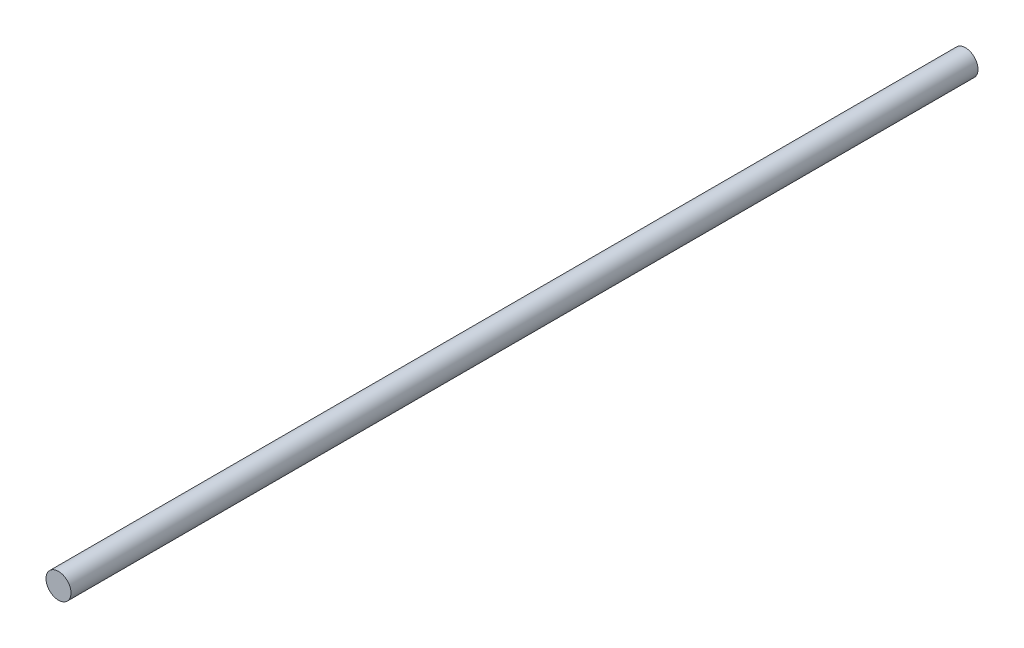
ISO-10303-21;
HEADER;
FILE_DESCRIPTION(('STEP AP214'),'2;1');
FILE_NAME('part.step','',(''),(''),'','','');
FILE_SCHEMA(('AUTOMOTIVE_DESIGN { 1 0 10303 214 1 1 1 1 }'));
ENDSEC;
DATA;
#1=APPLICATION_CONTEXT('core data for automotive mechanical design processes');
#2=APPLICATION_PROTOCOL_DEFINITION('international standard','automotive_design',2000,#1);
#3=PRODUCT_CONTEXT('',#1,'mechanical');
#4=PRODUCT('Part','Part','',(#3));
#5=PRODUCT_RELATED_PRODUCT_CATEGORY('part','',(#4));
#6=PRODUCT_DEFINITION_FORMATION('','',#4);
#7=PRODUCT_DEFINITION_CONTEXT('part definition',#1,'design');
#8=PRODUCT_DEFINITION('design','',#6,#7);
#9=PRODUCT_DEFINITION_SHAPE('','',#8);
#10=(LENGTH_UNIT() NAMED_UNIT(*) SI_UNIT(.MILLI.,.METRE.));
#11=(NAMED_UNIT(*) PLANE_ANGLE_UNIT() SI_UNIT($,.RADIAN.));
#12=(NAMED_UNIT(*) SI_UNIT($,.STERADIAN.) SOLID_ANGLE_UNIT());
#13=UNCERTAINTY_MEASURE_WITH_UNIT(LENGTH_MEASURE(1.E-05),#10,'distance_accuracy_value','');
#14=(GEOMETRIC_REPRESENTATION_CONTEXT(3) GLOBAL_UNCERTAINTY_ASSIGNED_CONTEXT((#13)) GLOBAL_UNIT_ASSIGNED_CONTEXT((#10,
#11,#12)) REPRESENTATION_CONTEXT('',''));
#15=CARTESIAN_POINT('',(0.,0.,0.));
#16=DIRECTION('',(0.,0.,1.));
#17=DIRECTION('',(1.,0.,0.));
#18=AXIS2_PLACEMENT_3D('',#15,#16,#17);
#19=CARTESIAN_POINT('',(0.,0.,290.));
#20=DIRECTION('',(0.,0.,-1.));
#21=DIRECTION('',(-1.,0.,0.));
#22=AXIS2_PLACEMENT_3D('',#19,#20,#21);
#23=CYLINDRICAL_SURFACE('',#22,4.);
#24=CARTESIAN_POINT('',(0.,0.,290.));
#25=DIRECTION('',(0.,0.,1.));
#26=DIRECTION('',(1.,0.,0.));
#27=AXIS2_PLACEMENT_3D('',#24,#25,#26);
#28=CIRCLE('',#27,4.);
#29=CARTESIAN_POINT('',(4.,0.,290.));
#30=VERTEX_POINT('',#29);
#31=EDGE_CURVE('E10',#30,#30,#28,.T.);
#32=ORIENTED_EDGE('',*,*,#31,.F.);
#33=EDGE_LOOP('',(#32));
#34=FACE_BOUND('',#33,.T.);
#35=CARTESIAN_POINT('',(0.,0.,0.));
#36=DIRECTION('',(0.,0.,1.));
#37=DIRECTION('',(1.,0.,0.));
#38=AXIS2_PLACEMENT_3D('',#35,#36,#37);
#39=CIRCLE('',#38,4.);
#40=CARTESIAN_POINT('',(4.,0.,0.));
#41=VERTEX_POINT('',#40);
#42=EDGE_CURVE('E33',#41,#41,#39,.T.);
#43=ORIENTED_EDGE('',*,*,#42,.T.);
#44=EDGE_LOOP('',(#43));
#45=FACE_BOUND('',#44,.T.);
#46=ADVANCED_FACE('F30',(#34,#45),#23,.T.);
#47=CARTESIAN_POINT('',(0.,0.,290.));
#48=DIRECTION('',(0.,0.,1.));
#49=DIRECTION('',(1.,0.,0.));
#50=AXIS2_PLACEMENT_3D('',#47,#48,#49);
#51=PLANE('',#50);
#52=ORIENTED_EDGE('',*,*,#31,.T.);
#53=EDGE_LOOP('',(#52));
#54=FACE_BOUND('',#53,.T.);
#55=ADVANCED_FACE('F45',(#54),#51,.T.);
#56=CARTESIAN_POINT('',(0.,0.,0.));
#57=DIRECTION('',(0.,0.,1.));
#58=DIRECTION('',(1.,0.,0.));
#59=AXIS2_PLACEMENT_3D('',#56,#57,#58);
#60=PLANE('',#59);
#61=ORIENTED_EDGE('',*,*,#42,.F.);
#62=EDGE_LOOP('',(#61));
#63=FACE_BOUND('',#62,.T.);
#64=ADVANCED_FACE('F43',(#63),#60,.F.);
#65=CLOSED_SHELL('',(#46,#55,#64));
#66=MANIFOLD_SOLID_BREP('B2',#65);
#67=ADVANCED_BREP_SHAPE_REPRESENTATION('',(#18,#66),#14);
#68=SHAPE_DEFINITION_REPRESENTATION(#9,#67);
ENDSEC;
END-ISO-10303-21;
